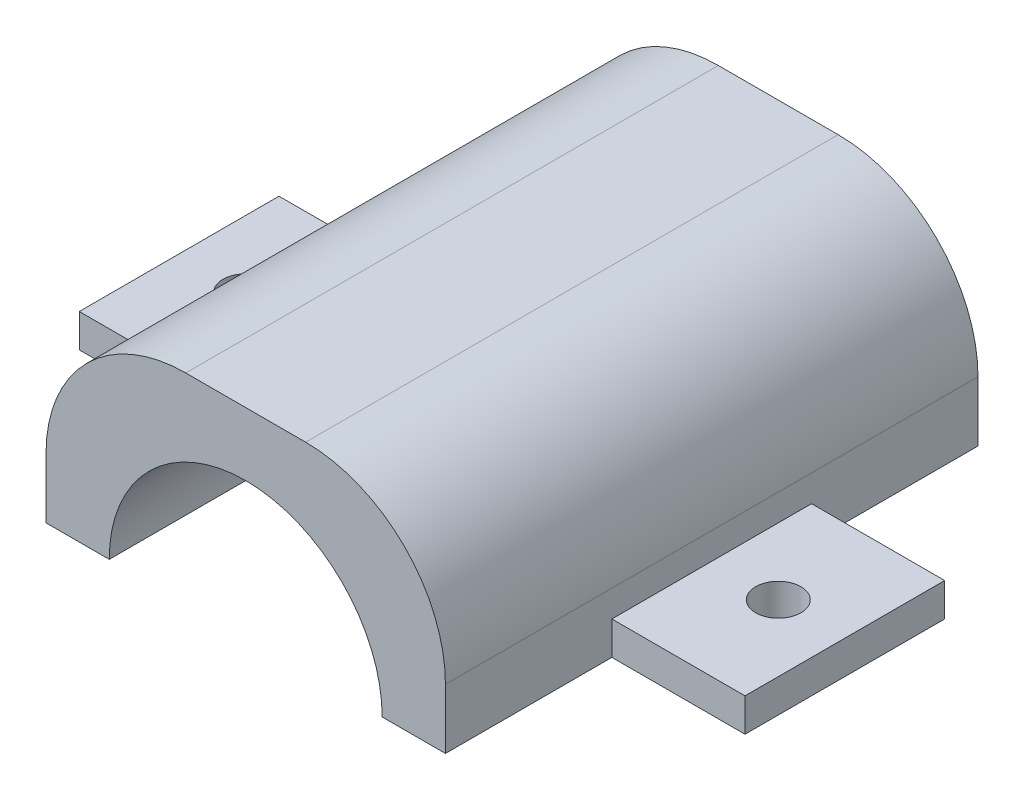
ISO-10303-21;
HEADER;
FILE_DESCRIPTION(('STEP AP214'),'2;1');
FILE_NAME('part.step','',(''),(''),'','','');
FILE_SCHEMA(('AUTOMOTIVE_DESIGN { 1 0 10303 214 1 1 1 1 }'));
ENDSEC;
DATA;
#1=APPLICATION_CONTEXT('core data for automotive mechanical design processes');
#2=APPLICATION_PROTOCOL_DEFINITION('international standard','automotive_design',2000,#1);
#3=PRODUCT_CONTEXT('',#1,'mechanical');
#4=PRODUCT('Part','Part','',(#3));
#5=PRODUCT_RELATED_PRODUCT_CATEGORY('part','',(#4));
#6=PRODUCT_DEFINITION_FORMATION('','',#4);
#7=PRODUCT_DEFINITION_CONTEXT('part definition',#1,'design');
#8=PRODUCT_DEFINITION('design','',#6,#7);
#9=PRODUCT_DEFINITION_SHAPE('','',#8);
#10=(LENGTH_UNIT() NAMED_UNIT(*) SI_UNIT(.MILLI.,.METRE.));
#11=(NAMED_UNIT(*) PLANE_ANGLE_UNIT() SI_UNIT($,.RADIAN.));
#12=(NAMED_UNIT(*) SI_UNIT($,.STERADIAN.) SOLID_ANGLE_UNIT());
#13=UNCERTAINTY_MEASURE_WITH_UNIT(LENGTH_MEASURE(1.E-05),#10,'distance_accuracy_value','');
#14=(GEOMETRIC_REPRESENTATION_CONTEXT(3) GLOBAL_UNCERTAINTY_ASSIGNED_CONTEXT((#13)) GLOBAL_UNIT_ASSIGNED_CONTEXT((#10,
#11,#12)) REPRESENTATION_CONTEXT('',''));
#15=CARTESIAN_POINT('',(0.,0.,0.));
#16=DIRECTION('',(0.,0.,1.));
#17=DIRECTION('',(1.,0.,0.));
#18=AXIS2_PLACEMENT_3D('',#15,#16,#17);
#19=CARTESIAN_POINT('',(-24.6596858638744,2.5,-6.8717277486911));
#20=DIRECTION('',(-1.,0.,0.));
#21=DIRECTION('',(0.,0.,1.));
#22=AXIS2_PLACEMENT_3D('',#19,#20,#21);
#23=PLANE('',#22);
#24=DIRECTION('',(0.,0.,-1.));
#25=VECTOR('',#24,1.);
#26=CARTESIAN_POINT('',(-24.6596858638744,0.,-6.8717277486911));
#27=LINE('',#26,#25);
#28=CARTESIAN_POINT('',(-24.6596858638744,0.,8.1282722513089));
#29=VERTEX_POINT('',#28);
#30=CARTESIAN_POINT('',(-24.6596858638744,0.,-6.8717277486911));
#31=VERTEX_POINT('',#30);
#32=EDGE_CURVE('E110',#29,#31,#27,.T.);
#33=ORIENTED_EDGE('',*,*,#32,.F.);
#34=DIRECTION('',(0.,-1.,0.));
#35=VECTOR('',#34,1.);
#36=CARTESIAN_POINT('',(-24.6596858638744,2.5,8.1282722513089));
#37=LINE('',#36,#35);
#38=CARTESIAN_POINT('',(-24.6596858638744,2.5,8.1282722513089));
#39=VERTEX_POINT('',#38);
#40=EDGE_CURVE('E12',#39,#29,#37,.T.);
#41=ORIENTED_EDGE('',*,*,#40,.F.);
#42=DIRECTION('',(0.,0.,-1.));
#43=VECTOR('',#42,1.);
#44=CARTESIAN_POINT('',(-24.6596858638744,2.5,-6.8717277486911));
#45=LINE('',#44,#43);
#46=CARTESIAN_POINT('',(-24.6596858638744,2.5,-6.8717277486911));
#47=VERTEX_POINT('',#46);
#48=EDGE_CURVE('E103',#39,#47,#45,.T.);
#49=ORIENTED_EDGE('',*,*,#48,.T.);
#50=DIRECTION('',(0.,-1.,0.));
#51=VECTOR('',#50,1.);
#52=CARTESIAN_POINT('',(-24.6596858638744,2.5,-6.8717277486911));
#53=LINE('',#52,#51);
#54=EDGE_CURVE('E48',#47,#31,#53,.T.);
#55=ORIENTED_EDGE('',*,*,#54,.T.);
#56=EDGE_LOOP('',(#33,#41,#49,#55));
#57=FACE_BOUND('',#56,.T.);
#58=ADVANCED_FACE('F45',(#57),#23,.T.);
#59=CARTESIAN_POINT('',(-24.6596858638744,2.5,8.1282722513089));
#60=DIRECTION('',(0.,0.,1.));
#61=DIRECTION('',(1.,0.,0.));
#62=AXIS2_PLACEMENT_3D('',#59,#60,#61);
#63=PLANE('',#62);
#64=DIRECTION('',(-1.,0.,0.));
#65=VECTOR('',#64,1.);
#66=CARTESIAN_POINT('',(-24.6596858638744,0.,8.1282722513089));
#67=LINE('',#66,#65);
#68=CARTESIAN_POINT('',(-14.6596858638744,0.,8.1282722513089));
#69=VERTEX_POINT('',#68);
#70=EDGE_CURVE('E105',#69,#29,#67,.T.);
#71=ORIENTED_EDGE('',*,*,#70,.F.);
#72=DIRECTION('',(0.,-1.,0.));
#73=VECTOR('',#72,1.);
#74=CARTESIAN_POINT('',(-14.6596858638744,2.5,8.1282722513089));
#75=LINE('',#74,#73);
#76=CARTESIAN_POINT('',(-14.6596858638744,2.5,8.1282722513089));
#77=VERTEX_POINT('',#76);
#78=EDGE_CURVE('E54',#77,#69,#75,.T.);
#79=ORIENTED_EDGE('',*,*,#78,.F.);
#80=DIRECTION('',(-1.,0.,0.));
#81=VECTOR('',#80,1.);
#82=CARTESIAN_POINT('',(-24.6596858638744,2.5,8.1282722513089));
#83=LINE('',#82,#81);
#84=EDGE_CURVE('E100',#77,#39,#83,.T.);
#85=ORIENTED_EDGE('',*,*,#84,.T.);
#86=ORIENTED_EDGE('',*,*,#40,.T.);
#87=EDGE_LOOP('',(#71,#79,#85,#86));
#88=FACE_BOUND('',#87,.T.);
#89=ADVANCED_FACE('F121',(#88),#63,.T.);
#90=CARTESIAN_POINT('',(-14.6596858638744,2.5,-6.87172774869109));
#91=DIRECTION('',(1.,0.,0.));
#92=DIRECTION('',(0.,0.,-1.));
#93=AXIS2_PLACEMENT_3D('',#90,#91,#92);
#94=PLANE('',#93);
#95=DIRECTION('',(0.,0.,1.));
#96=VECTOR('',#95,1.);
#97=CARTESIAN_POINT('',(-14.6596858638744,0.,-6.87172774869109));
#98=LINE('',#97,#96);
#99=CARTESIAN_POINT('',(-14.6596858638744,0.,-6.87172774869109));
#100=VERTEX_POINT('',#99);
#101=EDGE_CURVE('E95',#100,#69,#98,.T.);
#102=ORIENTED_EDGE('',*,*,#101,.F.);
#103=DIRECTION('',(0.,-1.,0.));
#104=VECTOR('',#103,1.);
#105=CARTESIAN_POINT('',(-14.6596858638744,2.5,-6.87172774869109));
#106=LINE('',#105,#104);
#107=CARTESIAN_POINT('',(-14.6596858638744,2.5,-6.87172774869109));
#108=VERTEX_POINT('',#107);
#109=EDGE_CURVE('E90',#108,#100,#106,.T.);
#110=ORIENTED_EDGE('',*,*,#109,.F.);
#111=DIRECTION('',(0.,0.,1.));
#112=VECTOR('',#111,1.);
#113=CARTESIAN_POINT('',(-14.6596858638744,2.5,-6.87172774869109));
#114=LINE('',#113,#112);
#115=EDGE_CURVE('E93',#108,#77,#114,.T.);
#116=ORIENTED_EDGE('',*,*,#115,.T.);
#117=ORIENTED_EDGE('',*,*,#78,.T.);
#118=EDGE_LOOP('',(#102,#110,#116,#117));
#119=FACE_BOUND('',#118,.T.);
#120=ADVANCED_FACE('F92',(#119),#94,.T.);
#121=CARTESIAN_POINT('',(-24.6596858638744,2.5,-6.8717277486911));
#122=DIRECTION('',(0.,0.,-1.));
#123=DIRECTION('',(-1.,0.,0.));
#124=AXIS2_PLACEMENT_3D('',#121,#122,#123);
#125=PLANE('',#124);
#126=DIRECTION('',(1.,0.,0.));
#127=VECTOR('',#126,1.);
#128=CARTESIAN_POINT('',(-24.6596858638744,0.,-6.8717277486911));
#129=LINE('',#128,#127);
#130=EDGE_CURVE('E113',#31,#100,#129,.T.);
#131=ORIENTED_EDGE('',*,*,#130,.F.);
#132=ORIENTED_EDGE('',*,*,#54,.F.);
#133=DIRECTION('',(1.,0.,0.));
#134=VECTOR('',#133,1.);
#135=CARTESIAN_POINT('',(-24.6596858638744,2.5,-6.8717277486911));
#136=LINE('',#135,#134);
#137=EDGE_CURVE('E99',#47,#108,#136,.T.);
#138=ORIENTED_EDGE('',*,*,#137,.T.);
#139=ORIENTED_EDGE('',*,*,#109,.T.);
#140=EDGE_LOOP('',(#131,#132,#138,#139));
#141=FACE_BOUND('',#140,.T.);
#142=ADVANCED_FACE('F102',(#141),#125,.T.);
#143=CARTESIAN_POINT('',(0.,2.5,0.));
#144=DIRECTION('',(0.,1.,0.));
#145=DIRECTION('',(0.,0.,1.));
#146=AXIS2_PLACEMENT_3D('',#143,#144,#145);
#147=PLANE('',#146);
#148=CARTESIAN_POINT('',(-19.6596858638744,2.5,0.6282722513089));
#149=DIRECTION('',(0.,1.,0.));
#150=DIRECTION('',(0.,0.,1.));
#151=AXIS2_PLACEMENT_3D('',#148,#149,#150);
#152=CIRCLE('',#151,1.7);
#153=CARTESIAN_POINT('',(-19.6596858638744,2.5,2.3282722513089));
#154=VERTEX_POINT('',#153);
#155=EDGE_CURVE('E114',#154,#154,#152,.T.);
#156=ORIENTED_EDGE('',*,*,#155,.F.);
#157=EDGE_LOOP('',(#156));
#158=FACE_BOUND('',#157,.T.);
#159=ORIENTED_EDGE('',*,*,#48,.F.);
#160=ORIENTED_EDGE('',*,*,#84,.F.);
#161=ORIENTED_EDGE('',*,*,#115,.F.);
#162=ORIENTED_EDGE('',*,*,#137,.F.);
#163=EDGE_LOOP('',(#159,#160,#161,#162));
#164=FACE_BOUND('',#163,.T.);
#165=ADVANCED_FACE('F98',(#158,#164),#147,.T.);
#166=CARTESIAN_POINT('',(0.,0.,0.));
#167=DIRECTION('',(0.,1.,0.));
#168=DIRECTION('',(0.,0.,1.));
#169=AXIS2_PLACEMENT_3D('',#166,#167,#168);
#170=PLANE('',#169);
#171=CARTESIAN_POINT('',(-19.6596858638744,0.,0.6282722513089));
#172=DIRECTION('',(0.,-1.,0.));
#173=DIRECTION('',(0.,0.,-1.));
#174=AXIS2_PLACEMENT_3D('',#171,#172,#173);
#175=CIRCLE('',#174,1.7);
#176=CARTESIAN_POINT('',(-19.6596858638744,0.,-1.0717277486911));
#177=VERTEX_POINT('',#176);
#178=EDGE_CURVE('E150',#177,#177,#175,.T.);
#179=ORIENTED_EDGE('',*,*,#178,.F.);
#180=EDGE_LOOP('',(#179));
#181=FACE_BOUND('',#180,.T.);
#182=ORIENTED_EDGE('',*,*,#32,.T.);
#183=ORIENTED_EDGE('',*,*,#130,.T.);
#184=ORIENTED_EDGE('',*,*,#101,.T.);
#185=ORIENTED_EDGE('',*,*,#70,.T.);
#186=EDGE_LOOP('',(#182,#183,#184,#185));
#187=FACE_BOUND('',#186,.T.);
#188=ADVANCED_FACE('F120',(#181,#187),#170,.F.);
#189=CARTESIAN_POINT('',(-19.6596858638744,0.,0.6282722513089));
#190=DIRECTION('',(0.,-1.,0.));
#191=DIRECTION('',(0.,0.,-1.));
#192=AXIS2_PLACEMENT_3D('',#189,#190,#191);
#193=CYLINDRICAL_SURFACE('',#192,1.7);
#194=ORIENTED_EDGE('',*,*,#178,.T.);
#195=EDGE_LOOP('',(#194));
#196=FACE_BOUND('',#195,.T.);
#197=ORIENTED_EDGE('',*,*,#155,.T.);
#198=EDGE_LOOP('',(#197));
#199=FACE_BOUND('',#198,.T.);
#200=ADVANCED_FACE('F139',(#196,#199),#193,.F.);
#201=CLOSED_SHELL('',(#58,#89,#120,#142,#165,#188,#200));
#202=MANIFOLD_SOLID_BREP('B2',#201);
#203=CARTESIAN_POINT('',(0.,0.,0.));
#204=DIRECTION('',(0.,1.,0.));
#205=DIRECTION('',(0.,0.,1.));
#206=AXIS2_PLACEMENT_3D('',#203,#204,#205);
#207=PLANE('',#206);
#208=DIRECTION('',(1.,0.,0.));
#209=VECTOR('',#208,1.);
#210=CARTESIAN_POINT('',(-14.6596858638744,0.,20.6282722513089));
#211=LINE('',#210,#209);
#212=CARTESIAN_POINT('',(10.5903141361256,0.,20.6282722513089));
#213=VERTEX_POINT('',#212);
#214=CARTESIAN_POINT('',(15.3403141361256,0.,20.6282722513089));
#215=VERTEX_POINT('',#214);
#216=EDGE_CURVE('E338',#213,#215,#211,.T.);
#217=ORIENTED_EDGE('',*,*,#216,.F.);
#218=DIRECTION('',(0.,0.,1.));
#219=VECTOR('',#218,1.);
#220=CARTESIAN_POINT('',(10.5903141361256,0.,-19.3717277486911));
#221=LINE('',#220,#219);
#222=CARTESIAN_POINT('',(10.5903141361256,0.,-19.3717277486911));
#223=VERTEX_POINT('',#222);
#224=EDGE_CURVE('E355',#213,#223,#221,.F.);
#225=ORIENTED_EDGE('',*,*,#224,.T.);
#226=DIRECTION('',(-1.,0.,0.));
#227=VECTOR('',#226,1.);
#228=CARTESIAN_POINT('',(-14.6596858638744,0.,-19.3717277486911));
#229=LINE('',#228,#227);
#230=CARTESIAN_POINT('',(15.3403141361256,0.,-19.3717277486911));
#231=VERTEX_POINT('',#230);
#232=EDGE_CURVE('E332',#231,#223,#229,.T.);
#233=ORIENTED_EDGE('',*,*,#232,.F.);
#234=DIRECTION('',(0.,0.,-1.));
#235=VECTOR('',#234,1.);
#236=CARTESIAN_POINT('',(15.3403141361256,0.,-19.3717277486911));
#237=LINE('',#236,#235);
#238=CARTESIAN_POINT('',(15.3403141361256,0.,-6.87172774869109));
#239=VERTEX_POINT('',#238);
#240=EDGE_CURVE('E342',#239,#231,#237,.T.);
#241=ORIENTED_EDGE('',*,*,#240,.F.);
#242=DIRECTION('',(1.,0.,0.));
#243=VECTOR('',#242,1.);
#244=CARTESIAN_POINT('',(15.3403141361257,0.,-6.87172774869109));
#245=LINE('',#244,#243);
#246=CARTESIAN_POINT('',(25.3403141361257,0.,-6.87172774869109));
#247=VERTEX_POINT('',#246);
#248=EDGE_CURVE('E284',#239,#247,#245,.T.);
#249=ORIENTED_EDGE('',*,*,#248,.T.);
#250=DIRECTION('',(0.,0.,1.));
#251=VECTOR('',#250,1.);
#252=CARTESIAN_POINT('',(25.3403141361256,0.,8.12827225130891));
#253=LINE('',#252,#251);
#254=CARTESIAN_POINT('',(25.3403141361256,0.,8.12827225130891));
#255=VERTEX_POINT('',#254);
#256=EDGE_CURVE('E307',#247,#255,#253,.T.);
#257=ORIENTED_EDGE('',*,*,#256,.T.);
#258=DIRECTION('',(-1.,0.,0.));
#259=VECTOR('',#258,1.);
#260=CARTESIAN_POINT('',(15.3403141361256,0.,8.1282722513089));
#261=LINE('',#260,#259);
#262=CARTESIAN_POINT('',(15.3403141361256,0.,8.1282722513089));
#263=VERTEX_POINT('',#262);
#264=EDGE_CURVE('E304',#255,#263,#261,.T.);
#265=ORIENTED_EDGE('',*,*,#264,.T.);
#266=EDGE_CURVE('E343',#215,#263,#237,.T.);
#267=ORIENTED_EDGE('',*,*,#266,.F.);
#268=EDGE_LOOP('',(#217,#225,#233,#241,#249,#257,#265,#267));
#269=FACE_BOUND('',#268,.T.);
#270=CARTESIAN_POINT('',(20.3403141361257,0.,0.628272251308907));
#271=DIRECTION('',(0.,-1.,0.));
#272=DIRECTION('',(0.,0.,-1.));
#273=AXIS2_PLACEMENT_3D('',#270,#271,#272);
#274=CIRCLE('',#273,1.7);
#275=CARTESIAN_POINT('',(20.3403141361257,0.,-1.07172774869109));
#276=VERTEX_POINT('',#275);
#277=EDGE_CURVE('E455',#276,#276,#274,.T.);
#278=ORIENTED_EDGE('',*,*,#277,.F.);
#279=EDGE_LOOP('',(#278));
#280=FACE_BOUND('',#279,.T.);
#281=ADVANCED_FACE('F190',(#269,#280),#207,.F.);
#282=CARTESIAN_POINT('',(15.3403141361256,15.,-19.3717277486911));
#283=DIRECTION('',(-1.,0.,0.));
#284=DIRECTION('',(0.,0.,1.));
#285=AXIS2_PLACEMENT_3D('',#282,#283,#284);
#286=PLANE('',#285);
#287=DIRECTION('',(0.,-1.,0.));
#288=VECTOR('',#287,1.);
#289=CARTESIAN_POINT('',(15.3403141361256,15.,-19.3717277486911));
#290=LINE('',#289,#288);
#291=CARTESIAN_POINT('',(15.3403141361256,4.5,-19.3717277486911));
#292=VERTEX_POINT('',#291);
#293=EDGE_CURVE('E349',#292,#231,#290,.T.);
#294=ORIENTED_EDGE('',*,*,#293,.F.);
#295=DIRECTION('',(0.,0.,-1.));
#296=VECTOR('',#295,1.);
#297=CARTESIAN_POINT('',(15.3403141361256,4.5,20.6282722513089));
#298=LINE('',#297,#296);
#299=CARTESIAN_POINT('',(15.3403141361256,4.5,20.6282722513089));
#300=VERTEX_POINT('',#299);
#301=EDGE_CURVE('E213',#292,#300,#298,.F.);
#302=ORIENTED_EDGE('',*,*,#301,.T.);
#303=DIRECTION('',(0.,-1.,0.));
#304=VECTOR('',#303,1.);
#305=CARTESIAN_POINT('',(15.3403141361256,15.,20.6282722513089));
#306=LINE('',#305,#304);
#307=EDGE_CURVE('E351',#300,#215,#306,.T.);
#308=ORIENTED_EDGE('',*,*,#307,.T.);
#309=ORIENTED_EDGE('',*,*,#266,.T.);
#310=DIRECTION('',(0.,-1.,0.));
#311=VECTOR('',#310,1.);
#312=CARTESIAN_POINT('',(15.3403141361256,2.5,8.1282722513089));
#313=LINE('',#312,#311);
#314=CARTESIAN_POINT('',(15.3403141361256,2.5,8.1282722513089));
#315=VERTEX_POINT('',#314);
#316=EDGE_CURVE('E303',#315,#263,#313,.T.);
#317=ORIENTED_EDGE('',*,*,#316,.F.);
#318=DIRECTION('',(0.,0.,-1.));
#319=VECTOR('',#318,1.);
#320=CARTESIAN_POINT('',(15.3403141361256,2.5,8.1282722513089));
#321=LINE('',#320,#319);
#322=CARTESIAN_POINT('',(15.3403141361257,2.5,-6.87172774869109));
#323=VERTEX_POINT('',#322);
#324=EDGE_CURVE('E295',#315,#323,#321,.T.);
#325=ORIENTED_EDGE('',*,*,#324,.T.);
#326=DIRECTION('',(0.,-1.,0.));
#327=VECTOR('',#326,1.);
#328=CARTESIAN_POINT('',(15.3403141361257,2.5,-6.87172774869109));
#329=LINE('',#328,#327);
#330=EDGE_CURVE('E279',#323,#239,#329,.T.);
#331=ORIENTED_EDGE('',*,*,#330,.T.);
#332=ORIENTED_EDGE('',*,*,#240,.T.);
#333=EDGE_LOOP('',(#294,#302,#308,#309,#317,#325,#331,#332));
#334=FACE_BOUND('',#333,.T.);
#335=ADVANCED_FACE('F301',(#334),#286,.F.);
#336=CARTESIAN_POINT('',(-9.90968586387435,0.,-19.3717277486911));
#337=VERTEX_POINT('',#336);
#338=CARTESIAN_POINT('',(-14.6596858638744,0.,-19.3717277486911));
#339=VERTEX_POINT('',#338);
#340=EDGE_CURVE('E345',#337,#339,#229,.T.);
#341=ORIENTED_EDGE('',*,*,#340,.F.);
#342=DIRECTION('',(0.,0.,1.));
#343=VECTOR('',#342,1.);
#344=CARTESIAN_POINT('',(-9.90968586387435,0.,-19.3717277486911));
#345=LINE('',#344,#343);
#346=CARTESIAN_POINT('',(-9.90968586387435,0.,20.6282722513089));
#347=VERTEX_POINT('',#346);
#348=EDGE_CURVE('E358',#337,#347,#345,.T.);
#349=ORIENTED_EDGE('',*,*,#348,.T.);
#350=CARTESIAN_POINT('',(-14.6596858638744,0.,20.6282722513089));
#351=VERTEX_POINT('',#350);
#352=EDGE_CURVE('E339',#351,#347,#211,.T.);
#353=ORIENTED_EDGE('',*,*,#352,.F.);
#354=DIRECTION('',(0.,0.,1.));
#355=VECTOR('',#354,1.);
#356=CARTESIAN_POINT('',(-14.6596858638744,0.,-19.3717277486911));
#357=LINE('',#356,#355);
#358=EDGE_CURVE('E326',#339,#351,#357,.T.);
#359=ORIENTED_EDGE('',*,*,#358,.F.);
#360=EDGE_LOOP('',(#341,#349,#353,#359));
#361=FACE_BOUND('',#360,.T.);
#362=ADVANCED_FACE('F394',(#361),#207,.F.);
#363=CARTESIAN_POINT('',(-14.6596858638744,15.,-19.3717277486911));
#364=DIRECTION('',(1.,0.,0.));
#365=DIRECTION('',(0.,0.,-1.));
#366=AXIS2_PLACEMENT_3D('',#363,#364,#365);
#367=PLANE('',#366);
#368=DIRECTION('',(0.,-1.,0.));
#369=VECTOR('',#368,1.);
#370=CARTESIAN_POINT('',(-14.6596858638744,15.,20.6282722513089));
#371=LINE('',#370,#369);
#372=CARTESIAN_POINT('',(-14.6596858638744,4.5,20.6282722513089));
#373=VERTEX_POINT('',#372);
#374=EDGE_CURVE('E353',#373,#351,#371,.T.);
#375=ORIENTED_EDGE('',*,*,#374,.F.);
#376=DIRECTION('',(0.,0.,1.));
#377=VECTOR('',#376,1.);
#378=CARTESIAN_POINT('',(-14.6596858638744,4.5,-19.3717277486911));
#379=LINE('',#378,#377);
#380=CARTESIAN_POINT('',(-14.6596858638744,4.5,-19.3717277486911));
#381=VERTEX_POINT('',#380);
#382=EDGE_CURVE('E43',#373,#381,#379,.F.);
#383=ORIENTED_EDGE('',*,*,#382,.T.);
#384=DIRECTION('',(0.,-1.,0.));
#385=VECTOR('',#384,1.);
#386=CARTESIAN_POINT('',(-14.6596858638744,15.,-19.3717277486911));
#387=LINE('',#386,#385);
#388=EDGE_CURVE('E335',#381,#339,#387,.T.);
#389=ORIENTED_EDGE('',*,*,#388,.T.);
#390=ORIENTED_EDGE('',*,*,#358,.T.);
#391=EDGE_LOOP('',(#375,#383,#389,#390));
#392=FACE_BOUND('',#391,.T.);
#393=ADVANCED_FACE('F397',(#392),#367,.F.);
#394=CARTESIAN_POINT('',(-14.6596858638744,15.,20.6282722513089));
#395=DIRECTION('',(0.,0.,-1.));
#396=DIRECTION('',(-1.,0.,0.));
#397=AXIS2_PLACEMENT_3D('',#394,#395,#396);
#398=PLANE('',#397);
#399=ORIENTED_EDGE('',*,*,#307,.F.);
#400=CARTESIAN_POINT('',(4.84031413612565,4.5,20.6282722513089));
#401=DIRECTION('',(0.,0.,-1.));
#402=DIRECTION('',(-1.,0.,0.));
#403=AXIS2_PLACEMENT_3D('',#400,#401,#402);
#404=CIRCLE('',#403,10.5);
#405=CARTESIAN_POINT('',(4.84031413612565,15.,20.6282722513089));
#406=VERTEX_POINT('',#405);
#407=EDGE_CURVE('E198',#300,#406,#404,.F.);
#408=ORIENTED_EDGE('',*,*,#407,.T.);
#409=DIRECTION('',(1.,0.,0.));
#410=VECTOR('',#409,1.);
#411=CARTESIAN_POINT('',(-14.6596858638744,15.,20.6282722513089));
#412=LINE('',#411,#410);
#413=CARTESIAN_POINT('',(-4.15968586387435,15.,20.6282722513089));
#414=VERTEX_POINT('',#413);
#415=EDGE_CURVE('E328',#414,#406,#412,.T.);
#416=ORIENTED_EDGE('',*,*,#415,.F.);
#417=CARTESIAN_POINT('',(-4.15968586387435,4.5,20.6282722513089));
#418=DIRECTION('',(0.,0.,-1.));
#419=DIRECTION('',(-1.,0.,0.));
#420=AXIS2_PLACEMENT_3D('',#417,#418,#419);
#421=CIRCLE('',#420,10.5);
#422=EDGE_CURVE('E205',#414,#373,#421,.F.);
#423=ORIENTED_EDGE('',*,*,#422,.T.);
#424=ORIENTED_EDGE('',*,*,#374,.T.);
#425=ORIENTED_EDGE('',*,*,#352,.T.);
#426=CARTESIAN_POINT('',(0.340314136125647,0.,20.6282722513089));
#427=DIRECTION('',(0.,0.,1.));
#428=DIRECTION('',(1.,0.,0.));
#429=AXIS2_PLACEMENT_3D('',#426,#427,#428);
#430=CIRCLE('',#429,10.25);
#431=EDGE_CURVE('E319',#213,#347,#430,.T.);
#432=ORIENTED_EDGE('',*,*,#431,.F.);
#433=ORIENTED_EDGE('',*,*,#216,.T.);
#434=EDGE_LOOP('',(#399,#408,#416,#423,#424,#425,#432,#433));
#435=FACE_BOUND('',#434,.T.);
#436=ADVANCED_FACE('F373',(#435),#398,.F.);
#437=CARTESIAN_POINT('',(-14.6596858638744,15.,-19.3717277486911));
#438=DIRECTION('',(0.,0.,1.));
#439=DIRECTION('',(1.,0.,0.));
#440=AXIS2_PLACEMENT_3D('',#437,#438,#439);
#441=PLANE('',#440);
#442=DIRECTION('',(-1.,0.,0.));
#443=VECTOR('',#442,1.);
#444=CARTESIAN_POINT('',(-14.6596858638744,15.,-19.3717277486911));
#445=LINE('',#444,#443);
#446=CARTESIAN_POINT('',(4.84031413612565,15.,-19.3717277486911));
#447=VERTEX_POINT('',#446);
#448=CARTESIAN_POINT('',(-4.15968586387435,15.,-19.3717277486911));
#449=VERTEX_POINT('',#448);
#450=EDGE_CURVE('E331',#447,#449,#445,.T.);
#451=ORIENTED_EDGE('',*,*,#450,.F.);
#452=CARTESIAN_POINT('',(4.84031413612565,4.5,-19.3717277486911));
#453=DIRECTION('',(0.,0.,1.));
#454=DIRECTION('',(1.,0.,0.));
#455=AXIS2_PLACEMENT_3D('',#452,#453,#454);
#456=CIRCLE('',#455,10.5);
#457=EDGE_CURVE('E369',#447,#292,#456,.F.);
#458=ORIENTED_EDGE('',*,*,#457,.T.);
#459=ORIENTED_EDGE('',*,*,#293,.T.);
#460=ORIENTED_EDGE('',*,*,#232,.T.);
#461=CARTESIAN_POINT('',(0.340314136125647,0.,-19.3717277486911));
#462=DIRECTION('',(0.,0.,1.));
#463=DIRECTION('',(1.,0.,0.));
#464=AXIS2_PLACEMENT_3D('',#461,#462,#463);
#465=CIRCLE('',#464,10.25);
#466=EDGE_CURVE('E323',#223,#337,#465,.T.);
#467=ORIENTED_EDGE('',*,*,#466,.T.);
#468=ORIENTED_EDGE('',*,*,#340,.T.);
#469=ORIENTED_EDGE('',*,*,#388,.F.);
#470=CARTESIAN_POINT('',(-4.15968586387435,4.5,-19.3717277486911));
#471=DIRECTION('',(0.,0.,1.));
#472=DIRECTION('',(1.,0.,0.));
#473=AXIS2_PLACEMENT_3D('',#470,#471,#472);
#474=CIRCLE('',#473,10.5);
#475=EDGE_CURVE('E367',#381,#449,#474,.F.);
#476=ORIENTED_EDGE('',*,*,#475,.T.);
#477=EDGE_LOOP('',(#451,#458,#459,#460,#467,#468,#469,#476));
#478=FACE_BOUND('',#477,.T.);
#479=ADVANCED_FACE('F383',(#478),#441,.F.);
#480=CARTESIAN_POINT('',(0.,15.,0.));
#481=DIRECTION('',(0.,1.,0.));
#482=DIRECTION('',(0.,0.,1.));
#483=AXIS2_PLACEMENT_3D('',#480,#481,#482);
#484=PLANE('',#483);
#485=ORIENTED_EDGE('',*,*,#415,.T.);
#486=DIRECTION('',(0.,0.,-1.));
#487=VECTOR('',#486,1.);
#488=CARTESIAN_POINT('',(4.84031413612565,15.,-19.3717277486911));
#489=LINE('',#488,#487);
#490=EDGE_CURVE('E364',#406,#447,#489,.T.);
#491=ORIENTED_EDGE('',*,*,#490,.T.);
#492=ORIENTED_EDGE('',*,*,#450,.T.);
#493=DIRECTION('',(0.,0.,1.));
#494=VECTOR('',#493,1.);
#495=CARTESIAN_POINT('',(-4.15968586387435,15.,20.6282722513089));
#496=LINE('',#495,#494);
#497=EDGE_CURVE('E361',#449,#414,#496,.T.);
#498=ORIENTED_EDGE('',*,*,#497,.T.);
#499=EDGE_LOOP('',(#485,#491,#492,#498));
#500=FACE_BOUND('',#499,.T.);
#501=ADVANCED_FACE('F378',(#500),#484,.T.);
#502=CARTESIAN_POINT('',(0.340314136125647,0.,-19.3717277486911));
#503=DIRECTION('',(0.,0.,1.));
#504=DIRECTION('',(1.,0.,0.));
#505=AXIS2_PLACEMENT_3D('',#502,#503,#504);
#506=CYLINDRICAL_SURFACE('',#505,10.25);
#507=ORIENTED_EDGE('',*,*,#466,.F.);
#508=ORIENTED_EDGE('',*,*,#224,.F.);
#509=ORIENTED_EDGE('',*,*,#431,.T.);
#510=ORIENTED_EDGE('',*,*,#348,.F.);
#511=EDGE_LOOP('',(#507,#508,#509,#510));
#512=FACE_BOUND('',#511,.T.);
#513=ADVANCED_FACE('F427',(#512),#506,.F.);
#514=CARTESIAN_POINT('',(15.3403141361256,2.5,8.1282722513089));
#515=DIRECTION('',(0.,0.,1.));
#516=DIRECTION('',(1.,0.,0.));
#517=AXIS2_PLACEMENT_3D('',#514,#515,#516);
#518=PLANE('',#517);
#519=ORIENTED_EDGE('',*,*,#264,.F.);
#520=DIRECTION('',(0.,-1.,0.));
#521=VECTOR('',#520,1.);
#522=CARTESIAN_POINT('',(25.3403141361256,2.5,8.12827225130891));
#523=LINE('',#522,#521);
#524=CARTESIAN_POINT('',(25.3403141361256,2.5,8.12827225130891));
#525=VERTEX_POINT('',#524);
#526=EDGE_CURVE('E320',#525,#255,#523,.T.);
#527=ORIENTED_EDGE('',*,*,#526,.F.);
#528=DIRECTION('',(-1.,0.,0.));
#529=VECTOR('',#528,1.);
#530=CARTESIAN_POINT('',(15.3403141361256,2.5,8.1282722513089));
#531=LINE('',#530,#529);
#532=EDGE_CURVE('E289',#525,#315,#531,.T.);
#533=ORIENTED_EDGE('',*,*,#532,.T.);
#534=ORIENTED_EDGE('',*,*,#316,.T.);
#535=EDGE_LOOP('',(#519,#527,#533,#534));
#536=FACE_BOUND('',#535,.T.);
#537=ADVANCED_FACE('F431',(#536),#518,.T.);
#538=CARTESIAN_POINT('',(25.3403141361256,2.5,8.12827225130891));
#539=DIRECTION('',(1.,0.,0.));
#540=DIRECTION('',(0.,0.,-1.));
#541=AXIS2_PLACEMENT_3D('',#538,#539,#540);
#542=PLANE('',#541);
#543=ORIENTED_EDGE('',*,*,#256,.F.);
#544=DIRECTION('',(0.,-1.,0.));
#545=VECTOR('',#544,1.);
#546=CARTESIAN_POINT('',(25.3403141361257,2.5,-6.87172774869109));
#547=LINE('',#546,#545);
#548=CARTESIAN_POINT('',(25.3403141361257,2.5,-6.87172774869109));
#549=VERTEX_POINT('',#548);
#550=EDGE_CURVE('E288',#549,#247,#547,.T.);
#551=ORIENTED_EDGE('',*,*,#550,.F.);
#552=DIRECTION('',(0.,0.,1.));
#553=VECTOR('',#552,1.);
#554=CARTESIAN_POINT('',(25.3403141361256,2.5,8.12827225130891));
#555=LINE('',#554,#553);
#556=EDGE_CURVE('E298',#549,#525,#555,.T.);
#557=ORIENTED_EDGE('',*,*,#556,.T.);
#558=ORIENTED_EDGE('',*,*,#526,.T.);
#559=EDGE_LOOP('',(#543,#551,#557,#558));
#560=FACE_BOUND('',#559,.T.);
#561=ADVANCED_FACE('F436',(#560),#542,.T.);
#562=CARTESIAN_POINT('',(15.3403141361257,2.5,-6.87172774869109));
#563=DIRECTION('',(0.,0.,-1.));
#564=DIRECTION('',(-1.,0.,0.));
#565=AXIS2_PLACEMENT_3D('',#562,#563,#564);
#566=PLANE('',#565);
#567=ORIENTED_EDGE('',*,*,#248,.F.);
#568=ORIENTED_EDGE('',*,*,#330,.F.);
#569=DIRECTION('',(1.,0.,0.));
#570=VECTOR('',#569,1.);
#571=CARTESIAN_POINT('',(15.3403141361257,2.5,-6.87172774869109));
#572=LINE('',#571,#570);
#573=EDGE_CURVE('E282',#323,#549,#572,.T.);
#574=ORIENTED_EDGE('',*,*,#573,.T.);
#575=ORIENTED_EDGE('',*,*,#550,.T.);
#576=EDGE_LOOP('',(#567,#568,#574,#575));
#577=FACE_BOUND('',#576,.T.);
#578=ADVANCED_FACE('F281',(#577),#566,.T.);
#579=CARTESIAN_POINT('',(0.,2.5,0.));
#580=DIRECTION('',(0.,-1.,0.));
#581=DIRECTION('',(0.,0.,-1.));
#582=AXIS2_PLACEMENT_3D('',#579,#580,#581);
#583=PLANE('',#582);
#584=CARTESIAN_POINT('',(20.3403141361257,2.5,0.628272251308907));
#585=DIRECTION('',(0.,-1.,0.));
#586=DIRECTION('',(0.,0.,-1.));
#587=AXIS2_PLACEMENT_3D('',#584,#585,#586);
#588=CIRCLE('',#587,1.7);
#589=CARTESIAN_POINT('',(20.3403141361257,2.5,-1.07172774869109));
#590=VERTEX_POINT('',#589);
#591=EDGE_CURVE('E310',#590,#590,#588,.T.);
#592=ORIENTED_EDGE('',*,*,#591,.T.);
#593=EDGE_LOOP('',(#592));
#594=FACE_BOUND('',#593,.T.);
#595=ORIENTED_EDGE('',*,*,#324,.F.);
#596=ORIENTED_EDGE('',*,*,#532,.F.);
#597=ORIENTED_EDGE('',*,*,#556,.F.);
#598=ORIENTED_EDGE('',*,*,#573,.F.);
#599=EDGE_LOOP('',(#595,#596,#597,#598));
#600=FACE_BOUND('',#599,.T.);
#601=ADVANCED_FACE('F293',(#594,#600),#583,.F.);
#602=CARTESIAN_POINT('',(20.3403141361257,0.,0.628272251308907));
#603=DIRECTION('',(0.,-1.,0.));
#604=DIRECTION('',(0.,0.,-1.));
#605=AXIS2_PLACEMENT_3D('',#602,#603,#604);
#606=CYLINDRICAL_SURFACE('',#605,1.7);
#607=ORIENTED_EDGE('',*,*,#591,.F.);
#608=EDGE_LOOP('',(#607));
#609=FACE_BOUND('',#608,.T.);
#610=ORIENTED_EDGE('',*,*,#277,.T.);
#611=EDGE_LOOP('',(#610));
#612=FACE_BOUND('',#611,.T.);
#613=ADVANCED_FACE('F405',(#609,#612),#606,.F.);
#614=CARTESIAN_POINT('',(4.84031413612565,4.5,0.));
#615=DIRECTION('',(0.,0.,1.));
#616=DIRECTION('',(1.,0.,0.));
#617=AXIS2_PLACEMENT_3D('',#614,#615,#616);
#618=CYLINDRICAL_SURFACE('',#617,10.5);
#619=ORIENTED_EDGE('',*,*,#407,.F.);
#620=ORIENTED_EDGE('',*,*,#301,.F.);
#621=ORIENTED_EDGE('',*,*,#457,.F.);
#622=ORIENTED_EDGE('',*,*,#490,.F.);
#623=EDGE_LOOP('',(#619,#620,#621,#622));
#624=FACE_BOUND('',#623,.T.);
#625=ADVANCED_FACE('F381',(#624),#618,.T.);
#626=CARTESIAN_POINT('',(-4.15968586387435,4.5,0.));
#627=DIRECTION('',(0.,0.,-1.));
#628=DIRECTION('',(-1.,0.,0.));
#629=AXIS2_PLACEMENT_3D('',#626,#627,#628);
#630=CYLINDRICAL_SURFACE('',#629,10.5);
#631=ORIENTED_EDGE('',*,*,#475,.F.);
#632=ORIENTED_EDGE('',*,*,#382,.F.);
#633=ORIENTED_EDGE('',*,*,#422,.F.);
#634=ORIENTED_EDGE('',*,*,#497,.F.);
#635=EDGE_LOOP('',(#631,#632,#633,#634));
#636=FACE_BOUND('',#635,.T.);
#637=ADVANCED_FACE('F192',(#636),#630,.T.);
#638=CLOSED_SHELL('',(#281,#335,#362,#393,#436,#479,#501,#513,#537,#561,#578,#601,#613,#625,#637));
#639=MANIFOLD_SOLID_BREP('B6',#638);
#640=ADVANCED_BREP_SHAPE_REPRESENTATION('',(#18,#202,#639),#14);
#641=SHAPE_DEFINITION_REPRESENTATION(#9,#640);
ENDSEC;
END-ISO-10303-21;
